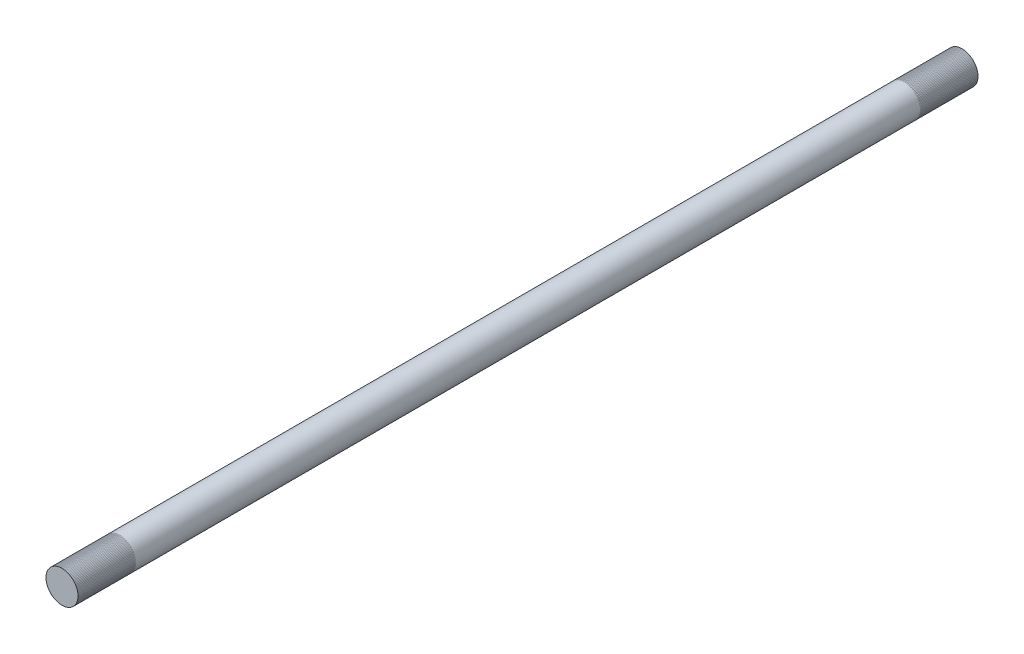
ISO-10303-21;
HEADER;
FILE_DESCRIPTION(('STEP AP214'),'2;1');
FILE_NAME('part.step','',(''),(''),'','','');
FILE_SCHEMA(('AUTOMOTIVE_DESIGN { 1 0 10303 214 1 1 1 1 }'));
ENDSEC;
DATA;
#1=APPLICATION_CONTEXT('core data for automotive mechanical design processes');
#2=APPLICATION_PROTOCOL_DEFINITION('international standard','automotive_design',2000,#1);
#3=PRODUCT_CONTEXT('',#1,'mechanical');
#4=PRODUCT('Part','Part','',(#3));
#5=PRODUCT_RELATED_PRODUCT_CATEGORY('part','',(#4));
#6=PRODUCT_DEFINITION_FORMATION('','',#4);
#7=PRODUCT_DEFINITION_CONTEXT('part definition',#1,'design');
#8=PRODUCT_DEFINITION('design','',#6,#7);
#9=PRODUCT_DEFINITION_SHAPE('','',#8);
#10=(LENGTH_UNIT() NAMED_UNIT(*) SI_UNIT(.MILLI.,.METRE.));
#11=(NAMED_UNIT(*) PLANE_ANGLE_UNIT() SI_UNIT($,.RADIAN.));
#12=(NAMED_UNIT(*) SI_UNIT($,.STERADIAN.) SOLID_ANGLE_UNIT());
#13=UNCERTAINTY_MEASURE_WITH_UNIT(LENGTH_MEASURE(1.E-05),#10,'distance_accuracy_value','');
#14=(GEOMETRIC_REPRESENTATION_CONTEXT(3) GLOBAL_UNCERTAINTY_ASSIGNED_CONTEXT((#13)) GLOBAL_UNIT_ASSIGNED_CONTEXT((#10,
#11,#12)) REPRESENTATION_CONTEXT('',''));
#15=CARTESIAN_POINT('',(0.,0.,0.));
#16=DIRECTION('',(0.,0.,1.));
#17=DIRECTION('',(1.,0.,0.));
#18=AXIS2_PLACEMENT_3D('',#15,#16,#17);
#19=CARTESIAN_POINT('',(0.,0.,-22.86));
#20=DIRECTION('',(0.,0.,1.));
#21=DIRECTION('',(1.,0.,0.));
#22=AXIS2_PLACEMENT_3D('',#19,#20,#21);
#23=PLANE('',#22);
#24=CARTESIAN_POINT('',(0.,0.,-22.86));
#25=DIRECTION('',(0.,0.,1.));
#26=DIRECTION('',(1.,0.,0.));
#27=AXIS2_PLACEMENT_3D('',#24,#25,#26);
#28=CIRCLE('',#27,6.35000000000006);
#29=CARTESIAN_POINT('',(6.35,0.,-22.86));
#30=VERTEX_POINT('',#29);
#31=EDGE_CURVE('E51',#30,#30,#28,.T.);
#32=ORIENTED_EDGE('',*,*,#31,.F.);
#33=EDGE_LOOP('',(#32));
#34=FACE_BOUND('',#33,.T.);
#35=ADVANCED_FACE('F44',(#34),#23,.F.);
#36=CARTESIAN_POINT('',(0.,0.,351.973897477371));
#37=DIRECTION('',(0.,0.,-1.));
#38=DIRECTION('',(-1.,0.,0.));
#39=AXIS2_PLACEMENT_3D('',#36,#37,#38);
#40=CYLINDRICAL_SURFACE('',#39,6.35000000000006);
#41=CARTESIAN_POINT('',(0.,0.,334.013385235233));
#42=DIRECTION('',(0.,0.,-1.));
#43=DIRECTION('',(0.,1.,0.));
#44=AXIS2_PLACEMENT_3D('',#41,#42,#43);
#45=CIRCLE('',#44,6.35000000000006);
#46=CARTESIAN_POINT('',(0.,6.35000000000006,334.013385235233));
#47=VERTEX_POINT('',#46);
#48=EDGE_CURVE('E11',#47,#47,#45,.T.);
#49=ORIENTED_EDGE('',*,*,#48,.T.);
#50=EDGE_LOOP('',(#49));
#51=FACE_BOUND('',#50,.T.);
#52=ORIENTED_EDGE('',*,*,#31,.T.);
#53=EDGE_LOOP('',(#52));
#54=FACE_BOUND('',#53,.T.);
#55=ADVANCED_FACE('F46',(#51,#54),#40,.T.);
#56=CARTESIAN_POINT('',(0.,0.,334.013385235233));
#57=DIRECTION('',(0.,0.,-1.));
#58=DIRECTION('',(0.,1.,0.));
#59=AXIS2_PLACEMENT_3D('',#56,#57,#58);
#60=PLANE('',#59);
#61=ORIENTED_EDGE('',*,*,#48,.F.);
#62=EDGE_LOOP('',(#61));
#63=FACE_BOUND('',#62,.T.);
#64=ADVANCED_FACE('F62',(#63),#60,.F.);
#65=CLOSED_SHELL('',(#35,#55,#64));
#66=MANIFOLD_SOLID_BREP('B2',#65);
#67=CARTESIAN_POINT('',(-8.29891710907305E-12,-1.51961776495568E-12,322.583385235233));
#68=DIRECTION('',(0.,0.,1.));
#69=DIRECTION('',(-0.469199705637428,-0.883092088193384,0.));
#70=AXIS2_PLACEMENT_3D('',#67,#68,#69);
#71=CYLINDRICAL_SURFACE('',#70,6.35);
#72=CARTESIAN_POINT('',(-8.29544766212109E-12,-1.51961776495568E-12,311.153385235233));
#73=DIRECTION('',(0.,0.,1.));
#74=DIRECTION('',(-0.469199705637428,-0.883092088193384,0.));
#75=AXIS2_PLACEMENT_3D('',#72,#73,#74);
#76=CIRCLE('',#75,6.35);
#77=CARTESIAN_POINT('',(-2.97941813080596,-5.60763476002951,311.153385235233));
#78=VERTEX_POINT('',#77);
#79=EDGE_CURVE('E96',#78,#78,#76,.T.);
#80=ORIENTED_EDGE('',*,*,#79,.F.);
#81=EDGE_LOOP('',(#80));
#82=FACE_BOUND('',#81,.T.);
#83=CARTESIAN_POINT('',(-8.302386556025E-12,-1.52655665885959E-12,334.013385235233));
#84=DIRECTION('',(0.,0.,1.));
#85=DIRECTION('',(-0.469199705637428,-0.883092088193384,0.));
#86=AXIS2_PLACEMENT_3D('',#83,#84,#85);
#87=CIRCLE('',#86,6.35);
#88=CARTESIAN_POINT('',(-2.97941813080597,-5.60763476002951,334.013385235233));
#89=VERTEX_POINT('',#88);
#90=EDGE_CURVE('E43',#89,#89,#87,.F.);
#91=ORIENTED_EDGE('',*,*,#90,.F.);
#92=EDGE_LOOP('',(#91));
#93=FACE_BOUND('',#92,.T.);
#94=ADVANCED_FACE('F92',(#82,#93),#71,.F.);
#95=OPEN_SHELL('',(#94));
#96=SHELL_BASED_SURFACE_MODEL('B6',(#95));
#97=CARTESIAN_POINT('',(0.,0.,-11.43));
#98=DIRECTION('',(0.,0.,-1.));
#99=DIRECTION('',(-1.,0.,0.));
#100=AXIS2_PLACEMENT_3D('',#97,#98,#99);
#101=CYLINDRICAL_SURFACE('',#100,6.35);
#102=CARTESIAN_POINT('',(0.,0.,-22.86));
#103=DIRECTION('',(0.,0.,-1.));
#104=DIRECTION('',(-1.,0.,0.));
#105=AXIS2_PLACEMENT_3D('',#102,#103,#104);
#106=CIRCLE('',#105,6.35);
#107=CARTESIAN_POINT('',(-6.35000000000006,0.,-22.86));
#108=VERTEX_POINT('',#107);
#109=EDGE_CURVE('E133',#108,#108,#106,.F.);
#110=ORIENTED_EDGE('',*,*,#109,.F.);
#111=EDGE_LOOP('',(#110));
#112=FACE_BOUND('',#111,.T.);
#113=CARTESIAN_POINT('',(0.,0.,0.));
#114=DIRECTION('',(0.,0.,-1.));
#115=DIRECTION('',(-1.,0.,0.));
#116=AXIS2_PLACEMENT_3D('',#113,#114,#115);
#117=CIRCLE('',#116,6.35);
#118=CARTESIAN_POINT('',(-6.35000000000007,0.,0.));
#119=VERTEX_POINT('',#118);
#120=EDGE_CURVE('E91',#119,#119,#117,.T.);
#121=ORIENTED_EDGE('',*,*,#120,.F.);
#122=EDGE_LOOP('',(#121));
#123=FACE_BOUND('',#122,.T.);
#124=ADVANCED_FACE('F129',(#112,#123),#101,.F.);
#125=OPEN_SHELL('',(#124));
#126=SHELL_BASED_SURFACE_MODEL('B38',(#125));
#127=ADVANCED_BREP_SHAPE_REPRESENTATION('',(#18,#66),#14);
#128=MANIFOLD_SURFACE_SHAPE_REPRESENTATION('',(#18,#96,#126),#14);
#129=SHAPE_REPRESENTATION('',(#18),#14);
#130=SHAPE_DEFINITION_REPRESENTATION(#9,#129);
#131=SHAPE_REPRESENTATION_RELATIONSHIP('','',#129,#127);
#132=SHAPE_REPRESENTATION_RELATIONSHIP('','',#129,#128);
ENDSEC;
END-ISO-10303-21;
